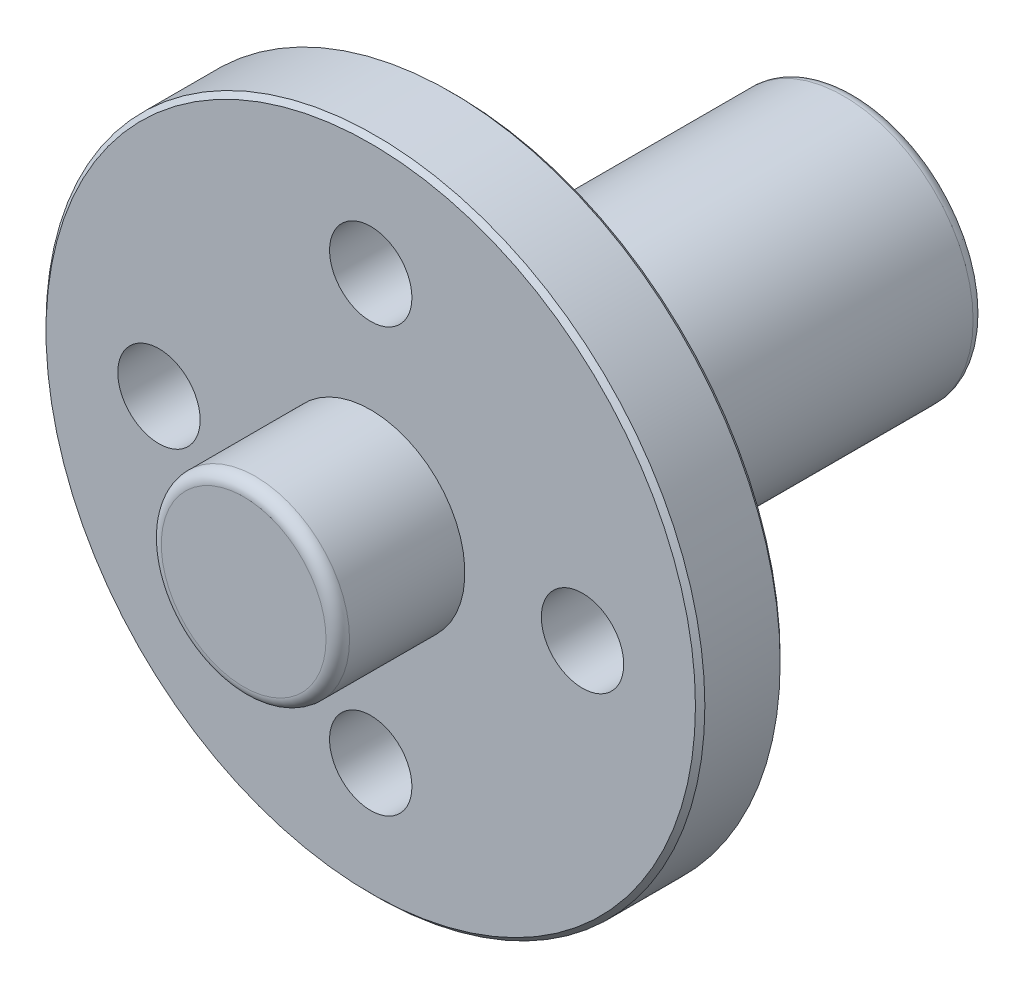
ISO-10303-21;
HEADER;
FILE_DESCRIPTION(('STEP AP214'),'2;1');
FILE_NAME('part.step','',(''),(''),'','','');
FILE_SCHEMA(('AUTOMOTIVE_DESIGN { 1 0 10303 214 1 1 1 1 }'));
ENDSEC;
DATA;
#1=APPLICATION_CONTEXT('core data for automotive mechanical design processes');
#2=APPLICATION_PROTOCOL_DEFINITION('international standard','automotive_design',2000,#1);
#3=PRODUCT_CONTEXT('',#1,'mechanical');
#4=PRODUCT('Part','Part','',(#3));
#5=PRODUCT_RELATED_PRODUCT_CATEGORY('part','',(#4));
#6=PRODUCT_DEFINITION_FORMATION('','',#4);
#7=PRODUCT_DEFINITION_CONTEXT('part definition',#1,'design');
#8=PRODUCT_DEFINITION('design','',#6,#7);
#9=PRODUCT_DEFINITION_SHAPE('','',#8);
#10=(LENGTH_UNIT() NAMED_UNIT(*) SI_UNIT(.MILLI.,.METRE.));
#11=(NAMED_UNIT(*) PLANE_ANGLE_UNIT() SI_UNIT($,.RADIAN.));
#12=(NAMED_UNIT(*) SI_UNIT($,.STERADIAN.) SOLID_ANGLE_UNIT());
#13=UNCERTAINTY_MEASURE_WITH_UNIT(LENGTH_MEASURE(1.E-05),#10,'distance_accuracy_value','');
#14=(GEOMETRIC_REPRESENTATION_CONTEXT(3) GLOBAL_UNCERTAINTY_ASSIGNED_CONTEXT((#13)) GLOBAL_UNIT_ASSIGNED_CONTEXT((#10,
#11,#12)) REPRESENTATION_CONTEXT('',''));
#15=CARTESIAN_POINT('',(0.,0.,0.));
#16=DIRECTION('',(0.,0.,1.));
#17=DIRECTION('',(1.,0.,0.));
#18=AXIS2_PLACEMENT_3D('',#15,#16,#17);
#19=CARTESIAN_POINT('',(0.,0.,3.6));
#20=DIRECTION('',(0.,0.,-1.));
#21=DIRECTION('',(-1.,0.,0.));
#22=AXIS2_PLACEMENT_3D('',#19,#20,#21);
#23=CYLINDRICAL_SURFACE('',#22,14.);
#24=CARTESIAN_POINT('',(0.,0.,0.2));
#25=DIRECTION('',(0.,0.,1.));
#26=DIRECTION('',(1.,0.,0.));
#27=AXIS2_PLACEMENT_3D('',#24,#25,#26);
#28=CIRCLE('',#27,14.);
#29=CARTESIAN_POINT('',(14.,0.,0.2));
#30=VERTEX_POINT('',#29);
#31=EDGE_CURVE('E60',#30,#30,#28,.T.);
#32=ORIENTED_EDGE('',*,*,#31,.T.);
#33=EDGE_LOOP('',(#32));
#34=FACE_BOUND('',#33,.T.);
#35=CARTESIAN_POINT('',(0.,0.,3.4));
#36=DIRECTION('',(0.,0.,1.));
#37=DIRECTION('',(1.,0.,0.));
#38=AXIS2_PLACEMENT_3D('',#35,#36,#37);
#39=CIRCLE('',#38,14.);
#40=CARTESIAN_POINT('',(14.,0.,3.4));
#41=VERTEX_POINT('',#40);
#42=EDGE_CURVE('E65',#41,#41,#39,.F.);
#43=ORIENTED_EDGE('',*,*,#42,.T.);
#44=EDGE_LOOP('',(#43));
#45=FACE_BOUND('',#44,.T.);
#46=ADVANCED_FACE('F46',(#34,#45),#23,.T.);
#47=CARTESIAN_POINT('',(0.,0.,3.6));
#48=DIRECTION('',(0.,0.,1.));
#49=DIRECTION('',(1.,0.,0.));
#50=AXIS2_PLACEMENT_3D('',#47,#48,#49);
#51=PLANE('',#50);
#52=CARTESIAN_POINT('',(0.,0.,3.6));
#53=DIRECTION('',(0.,0.,1.));
#54=DIRECTION('',(1.,0.,0.));
#55=AXIS2_PLACEMENT_3D('',#52,#53,#54);
#56=CIRCLE('',#55,13.8);
#57=CARTESIAN_POINT('',(13.8,0.,3.6));
#58=VERTEX_POINT('',#57);
#59=EDGE_CURVE('E12',#58,#58,#56,.T.);
#60=ORIENTED_EDGE('',*,*,#59,.T.);
#61=EDGE_LOOP('',(#60));
#62=FACE_BOUND('',#61,.T.);
#63=CARTESIAN_POINT('',(9.,0.,3.6));
#64=DIRECTION('',(0.,0.,1.));
#65=DIRECTION('',(1.,0.,0.));
#66=AXIS2_PLACEMENT_3D('',#63,#64,#65);
#67=CIRCLE('',#66,1.75);
#68=CARTESIAN_POINT('',(10.75,0.,3.6));
#69=VERTEX_POINT('',#68);
#70=EDGE_CURVE('E356',#69,#69,#67,.T.);
#71=ORIENTED_EDGE('',*,*,#70,.F.);
#72=EDGE_LOOP('',(#71));
#73=FACE_BOUND('',#72,.T.);
#74=CARTESIAN_POINT('',(0.,-9.,3.6));
#75=DIRECTION('',(0.,0.,1.));
#76=DIRECTION('',(1.,0.,0.));
#77=AXIS2_PLACEMENT_3D('',#74,#75,#76);
#78=CIRCLE('',#77,1.75);
#79=CARTESIAN_POINT('',(1.75,-9.,3.6));
#80=VERTEX_POINT('',#79);
#81=EDGE_CURVE('E360',#80,#80,#78,.T.);
#82=ORIENTED_EDGE('',*,*,#81,.F.);
#83=EDGE_LOOP('',(#82));
#84=FACE_BOUND('',#83,.T.);
#85=CARTESIAN_POINT('',(-9.,0.,3.6));
#86=DIRECTION('',(0.,0.,1.));
#87=DIRECTION('',(1.,0.,0.));
#88=AXIS2_PLACEMENT_3D('',#85,#86,#87);
#89=CIRCLE('',#88,1.75);
#90=CARTESIAN_POINT('',(-7.25,0.,3.6));
#91=VERTEX_POINT('',#90);
#92=EDGE_CURVE('E364',#91,#91,#89,.T.);
#93=ORIENTED_EDGE('',*,*,#92,.F.);
#94=EDGE_LOOP('',(#93));
#95=FACE_BOUND('',#94,.T.);
#96=CARTESIAN_POINT('',(0.,9.,3.6));
#97=DIRECTION('',(0.,0.,1.));
#98=DIRECTION('',(1.,0.,0.));
#99=AXIS2_PLACEMENT_3D('',#96,#97,#98);
#100=CIRCLE('',#99,1.75);
#101=CARTESIAN_POINT('',(1.75,9.,3.6));
#102=VERTEX_POINT('',#101);
#103=EDGE_CURVE('E341',#102,#102,#100,.T.);
#104=ORIENTED_EDGE('',*,*,#103,.F.);
#105=EDGE_LOOP('',(#104));
#106=FACE_BOUND('',#105,.T.);
#107=CARTESIAN_POINT('',(0.,0.,3.6));
#108=DIRECTION('',(0.,0.,1.));
#109=DIRECTION('',(1.,0.,0.));
#110=AXIS2_PLACEMENT_3D('',#107,#108,#109);
#111=CIRCLE('',#110,4.);
#112=CARTESIAN_POINT('',(-4.,0.,3.6));
#113=VERTEX_POINT('',#112);
#114=EDGE_CURVE('E98',#113,#113,#111,.T.);
#115=ORIENTED_EDGE('',*,*,#114,.F.);
#116=EDGE_LOOP('',(#115));
#117=FACE_BOUND('',#116,.T.);
#118=ADVANCED_FACE('F139',(#62,#73,#84,#95,#106,#117),#51,.T.);
#119=CARTESIAN_POINT('',(0.,0.,0.));
#120=DIRECTION('',(0.,0.,1.));
#121=DIRECTION('',(1.,0.,0.));
#122=AXIS2_PLACEMENT_3D('',#119,#120,#121);
#123=PLANE('',#122);
#124=CARTESIAN_POINT('',(0.,0.,0.));
#125=DIRECTION('',(0.,0.,1.));
#126=DIRECTION('',(1.,0.,0.));
#127=AXIS2_PLACEMENT_3D('',#124,#125,#126);
#128=CIRCLE('',#127,13.8);
#129=CARTESIAN_POINT('',(13.8,0.,0.));
#130=VERTEX_POINT('',#129);
#131=EDGE_CURVE('E55',#130,#130,#128,.F.);
#132=ORIENTED_EDGE('',*,*,#131,.T.);
#133=EDGE_LOOP('',(#132));
#134=FACE_BOUND('',#133,.T.);
#135=CARTESIAN_POINT('',(9.,0.,0.));
#136=DIRECTION('',(0.,0.,-1.));
#137=DIRECTION('',(0.,1.,0.));
#138=AXIS2_PLACEMENT_3D('',#135,#136,#137);
#139=CIRCLE('',#138,1.75);
#140=CARTESIAN_POINT('',(9.00000000000001,1.74999999999997,0.));
#141=VERTEX_POINT('',#140);
#142=EDGE_CURVE('E122',#141,#141,#139,.T.);
#143=ORIENTED_EDGE('',*,*,#142,.F.);
#144=EDGE_LOOP('',(#143));
#145=FACE_BOUND('',#144,.T.);
#146=CARTESIAN_POINT('',(0.,-9.,0.));
#147=DIRECTION('',(0.,0.,-1.));
#148=DIRECTION('',(1.,0.,0.));
#149=AXIS2_PLACEMENT_3D('',#146,#147,#148);
#150=CIRCLE('',#149,1.75);
#151=CARTESIAN_POINT('',(1.75,-9.,0.));
#152=VERTEX_POINT('',#151);
#153=EDGE_CURVE('E370',#152,#152,#150,.T.);
#154=ORIENTED_EDGE('',*,*,#153,.F.);
#155=EDGE_LOOP('',(#154));
#156=FACE_BOUND('',#155,.T.);
#157=CARTESIAN_POINT('',(-9.,0.,0.));
#158=DIRECTION('',(0.,0.,-1.));
#159=DIRECTION('',(0.,-1.,0.));
#160=AXIS2_PLACEMENT_3D('',#157,#158,#159);
#161=CIRCLE('',#160,1.75);
#162=CARTESIAN_POINT('',(-9.00000000000002,-1.74999999999991,0.));
#163=VERTEX_POINT('',#162);
#164=EDGE_CURVE('E121',#163,#163,#161,.T.);
#165=ORIENTED_EDGE('',*,*,#164,.F.);
#166=EDGE_LOOP('',(#165));
#167=FACE_BOUND('',#166,.T.);
#168=CARTESIAN_POINT('',(0.,9.,0.));
#169=DIRECTION('',(0.,0.,-1.));
#170=DIRECTION('',(-1.,0.,0.));
#171=AXIS2_PLACEMENT_3D('',#168,#169,#170);
#172=CIRCLE('',#171,1.75);
#173=CARTESIAN_POINT('',(-1.75,9.,0.));
#174=VERTEX_POINT('',#173);
#175=EDGE_CURVE('E352',#174,#174,#172,.T.);
#176=ORIENTED_EDGE('',*,*,#175,.F.);
#177=EDGE_LOOP('',(#176));
#178=FACE_BOUND('',#177,.T.);
#179=CARTESIAN_POINT('',(0.,0.,0.));
#180=DIRECTION('',(0.,0.,-1.));
#181=DIRECTION('',(-1.,0.,0.));
#182=AXIS2_PLACEMENT_3D('',#179,#180,#181);
#183=CIRCLE('',#182,5.5);
#184=CARTESIAN_POINT('',(-5.5,0.,0.));
#185=VERTEX_POINT('',#184);
#186=EDGE_CURVE('E87',#185,#185,#183,.T.);
#187=ORIENTED_EDGE('',*,*,#186,.F.);
#188=EDGE_LOOP('',(#187));
#189=FACE_BOUND('',#188,.T.);
#190=ADVANCED_FACE('F137',(#134,#145,#156,#167,#178,#189),#123,.F.);
#191=CARTESIAN_POINT('',(0.,0.,9.));
#192=DIRECTION('',(0.,0.,-1.));
#193=DIRECTION('',(-1.,0.,0.));
#194=AXIS2_PLACEMENT_3D('',#191,#192,#193);
#195=CYLINDRICAL_SURFACE('',#194,4.);
#196=CARTESIAN_POINT('',(0.,0.,8.5));
#197=DIRECTION('',(0.,0.,1.));
#198=DIRECTION('',(1.,0.,0.));
#199=AXIS2_PLACEMENT_3D('',#196,#197,#198);
#200=CIRCLE('',#199,4.);
#201=CARTESIAN_POINT('',(-4.,0.,8.5));
#202=VERTEX_POINT('',#201);
#203=EDGE_CURVE('E71',#202,#202,#200,.F.);
#204=CARTESIAN_POINT('',(-4.,0.,8.5));
#205=CARTESIAN_POINT('',(-4.,0.,8.44895833333333));
#206=CARTESIAN_POINT('',(-4.,0.,8.39791666666667));
#207=CARTESIAN_POINT('',(-4.,0.,8.29583333333333));
#208=CARTESIAN_POINT('',(-4.,0.,8.24479166666667));
#209=CARTESIAN_POINT('',(-4.,0.,8.14270833333333));
#210=CARTESIAN_POINT('',(-4.,0.,8.09166666666667));
#211=CARTESIAN_POINT('',(-4.,0.,7.98958333333333));
#212=CARTESIAN_POINT('',(-4.,0.,7.93854166666667));
#213=CARTESIAN_POINT('',(-4.,0.,7.83645833333333));
#214=CARTESIAN_POINT('',(-4.,0.,7.78541666666667));
#215=CARTESIAN_POINT('',(-4.,0.,7.68333333333333));
#216=CARTESIAN_POINT('',(-4.,0.,7.63229166666667));
#217=CARTESIAN_POINT('',(-4.,0.,7.53020833333333));
#218=CARTESIAN_POINT('',(-4.,0.,7.47916666666667));
#219=CARTESIAN_POINT('',(-4.,0.,7.37708333333333));
#220=CARTESIAN_POINT('',(-4.,0.,7.32604166666667));
#221=CARTESIAN_POINT('',(-4.,0.,7.22395833333333));
#222=CARTESIAN_POINT('',(-4.,0.,7.17291666666667));
#223=CARTESIAN_POINT('',(-4.,0.,7.07083333333333));
#224=CARTESIAN_POINT('',(-4.,0.,7.01979166666667));
#225=CARTESIAN_POINT('',(-4.,0.,6.91770833333333));
#226=CARTESIAN_POINT('',(-4.,0.,6.86666666666667));
#227=CARTESIAN_POINT('',(-4.,0.,6.76458333333333));
#228=CARTESIAN_POINT('',(-4.,0.,6.71354166666667));
#229=CARTESIAN_POINT('',(-4.,0.,6.61145833333333));
#230=CARTESIAN_POINT('',(-4.,0.,6.56041666666667));
#231=CARTESIAN_POINT('',(-4.,0.,6.45833333333333));
#232=CARTESIAN_POINT('',(-4.,0.,6.40729166666667));
#233=CARTESIAN_POINT('',(-4.,0.,6.30520833333333));
#234=CARTESIAN_POINT('',(-4.,0.,6.25416666666667));
#235=CARTESIAN_POINT('',(-4.,0.,6.15208333333333));
#236=CARTESIAN_POINT('',(-4.,0.,6.10104166666667));
#237=CARTESIAN_POINT('',(-4.,0.,5.99895833333333));
#238=CARTESIAN_POINT('',(-4.,0.,5.94791666666667));
#239=CARTESIAN_POINT('',(-4.,0.,5.84583333333333));
#240=CARTESIAN_POINT('',(-4.,0.,5.79479166666667));
#241=CARTESIAN_POINT('',(-4.,0.,5.69270833333333));
#242=CARTESIAN_POINT('',(-4.,0.,5.64166666666667));
#243=CARTESIAN_POINT('',(-4.,0.,5.53958333333333));
#244=CARTESIAN_POINT('',(-4.,0.,5.48854166666667));
#245=CARTESIAN_POINT('',(-4.,0.,5.38645833333333));
#246=CARTESIAN_POINT('',(-4.,0.,5.33541666666667));
#247=CARTESIAN_POINT('',(-4.,0.,5.23333333333333));
#248=CARTESIAN_POINT('',(-4.,0.,5.18229166666667));
#249=CARTESIAN_POINT('',(-4.,0.,5.08020833333333));
#250=CARTESIAN_POINT('',(-4.,0.,5.02916666666667));
#251=CARTESIAN_POINT('',(-4.,0.,4.92708333333333));
#252=CARTESIAN_POINT('',(-4.,0.,4.87604166666667));
#253=CARTESIAN_POINT('',(-4.,0.,4.77395833333333));
#254=CARTESIAN_POINT('',(-4.,0.,4.72291666666667));
#255=CARTESIAN_POINT('',(-4.,0.,4.62083333333333));
#256=CARTESIAN_POINT('',(-4.,0.,4.56979166666667));
#257=CARTESIAN_POINT('',(-4.,0.,4.46770833333333));
#258=CARTESIAN_POINT('',(-4.,0.,4.41666666666667));
#259=CARTESIAN_POINT('',(-4.,0.,4.31458333333333));
#260=CARTESIAN_POINT('',(-4.,0.,4.26354166666667));
#261=CARTESIAN_POINT('',(-4.,0.,4.16145833333333));
#262=CARTESIAN_POINT('',(-4.,0.,4.11041666666667));
#263=CARTESIAN_POINT('',(-4.,0.,4.00833333333333));
#264=CARTESIAN_POINT('',(-4.,0.,3.95729166666667));
#265=CARTESIAN_POINT('',(-4.,0.,3.85520833333333));
#266=CARTESIAN_POINT('',(-4.,0.,3.80416666666667));
#267=CARTESIAN_POINT('',(-4.,0.,3.70208333333333));
#268=CARTESIAN_POINT('',(-4.,0.,3.65104166666667));
#269=CARTESIAN_POINT('',(-4.,0.,3.6));
#270=B_SPLINE_CURVE_WITH_KNOTS('',3,(#204,#205,#206,#207,#208,#209,#210,#211,#212,#213,#214,
#215,#216,#217,#218,#219,#220,#221,#222,#223,#224,#225,#226,#227,#228,#229,#230,#231,#232,#233,
#234,#235,#236,#237,#238,#239,#240,#241,#242,#243,#244,#245,#246,#247,#248,#249,#250,#251,#252,
#253,#254,#255,#256,#257,#258,#259,#260,#261,#262,#263,#264,#265,#266,#267,#268,#269),
.UNSPECIFIED.,.F.,.F.,(4,2,2,2,2,2,2,2,2,2,2,2,2,2,2,2,2,2,2,2,2,2,2,2,2,2,2,2,2,2,2,2,4),(0.,
0.153124999999999,0.306249999999999,0.459375,0.612499999999998,0.765624999999999,
0.918749999999999,1.071875,1.225,1.378125,1.53125,1.684375,1.8375,1.990625,2.14375,2.296875,
2.45,2.603125,2.75625,2.909375,3.0625,3.215625,3.36875,3.521875,3.675,3.828125,3.98125,4.134375,
4.2875,4.440625,4.59375,4.746875,4.9),.UNSPECIFIED.);
#271=EDGE_CURVE('BSEAM133',#202,#113,#270,.T.);
#272=ORIENTED_EDGE('',*,*,#203,.T.);
#273=ORIENTED_EDGE('',*,*,#114,.T.);
#274=ORIENTED_EDGE('',*,*,#271,.T.);
#275=ORIENTED_EDGE('',*,*,#271,.F.);
#276=EDGE_LOOP('',(#272,#274,#273,#275));
#277=FACE_BOUND('',#276,.T.);
#278=ADVANCED_FACE('F133',(#277),#195,.T.);
#279=CARTESIAN_POINT('',(0.,0.,9.));
#280=DIRECTION('',(0.,0.,1.));
#281=DIRECTION('',(1.,0.,0.));
#282=AXIS2_PLACEMENT_3D('',#279,#280,#281);
#283=PLANE('',#282);
#284=CARTESIAN_POINT('',(0.,0.,9.));
#285=DIRECTION('',(0.,0.,1.));
#286=DIRECTION('',(1.,0.,0.));
#287=AXIS2_PLACEMENT_3D('',#284,#285,#286);
#288=CIRCLE('',#287,3.5);
#289=CARTESIAN_POINT('',(3.5,0.,9.));
#290=VERTEX_POINT('',#289);
#291=EDGE_CURVE('E75',#290,#290,#288,.T.);
#292=ORIENTED_EDGE('',*,*,#291,.T.);
#293=EDGE_LOOP('',(#292));
#294=FACE_BOUND('',#293,.T.);
#295=ADVANCED_FACE('F129',(#294),#283,.T.);
#296=CARTESIAN_POINT('',(0.,0.,-17.));
#297=DIRECTION('',(0.,0.,1.));
#298=DIRECTION('',(1.,0.,0.));
#299=AXIS2_PLACEMENT_3D('',#296,#297,#298);
#300=CYLINDRICAL_SURFACE('',#299,5.5);
#301=CARTESIAN_POINT('',(0.,0.,-16.5));
#302=DIRECTION('',(0.,0.,-1.));
#303=DIRECTION('',(-1.,0.,0.));
#304=AXIS2_PLACEMENT_3D('',#301,#302,#303);
#305=CIRCLE('',#304,5.5);
#306=CARTESIAN_POINT('',(-5.5,0.,-16.5));
#307=VERTEX_POINT('',#306);
#308=EDGE_CURVE('E79',#307,#307,#305,.F.);
#309=ORIENTED_EDGE('',*,*,#308,.T.);
#310=EDGE_LOOP('',(#309));
#311=FACE_BOUND('',#310,.T.);
#312=CARTESIAN_POINT('',(0.,-5.5,-9.25));
#313=CARTESIAN_POINT('',(0.0957269565011819,-5.49999970390343,-9.2500003560453));
#314=CARTESIAN_POINT('',(0.191458016099595,-5.49747737607821,-9.25788035677476));
#315=CARTESIAN_POINT('',(0.380115126410566,-5.4876627753594,-9.28910586620763));
#316=CARTESIAN_POINT('',(0.473040631526423,-5.48036958084595,-9.31245436307377));
#317=CARTESIAN_POINT('',(0.653339115590298,-5.46180884308535,-9.3737459025554));
#318=CARTESIAN_POINT('',(0.740720621291876,-5.45054758667823,-9.41166586727));
#319=CARTESIAN_POINT('',(0.907884643194976,-5.42520988974348,-9.50092410432208));
#320=CARTESIAN_POINT('',(0.987665875272176,-5.41113297472977,-9.55226463870048));
#321=CARTESIAN_POINT('',(1.13990943224763,-5.38115262585258,-9.66862926862347));
#322=CARTESIAN_POINT('',(1.2120954742211,-5.36520832184273,-9.73400425843164));
#323=CARTESIAN_POINT('',(1.34468623549642,-5.33352371951507,-9.87583522607003));
#324=CARTESIAN_POINT('',(1.40508865839976,-5.31778346151871,-9.95229335873924));
#325=CARTESIAN_POINT('',(1.51391658522971,-5.28784763379036,-10.1165374423305));
#326=CARTESIAN_POINT('',(1.56199322125746,-5.2737023408234,-10.2045645896092));
#327=CARTESIAN_POINT('',(1.64254455879642,-5.24917452933664,-10.3879775531033));
#328=CARTESIAN_POINT('',(1.67502354214116,-5.23879097834413,-10.4833613414355));
#329=CARTESIAN_POINT('',(1.72243983182188,-5.22339057458748,-10.6756556279128));
#330=CARTESIAN_POINT('',(1.73789106620494,-5.21821692266284,-10.7724264873046));
#331=CARTESIAN_POINT('',(1.75241914239356,-5.21335700674595,-10.9673146975367));
#332=CARTESIAN_POINT('',(1.75150052185658,-5.21366922209319,-11.0654316677053));
#333=CARTESIAN_POINT('',(1.73371613817389,-5.21960762396158,-11.2559411944999));
#334=CARTESIAN_POINT('',(1.71750822888944,-5.22501458741932,-11.3484031562964));
#335=CARTESIAN_POINT('',(1.67067371892857,-5.24017643369277,-11.529220390042));
#336=CARTESIAN_POINT('',(1.64004553449478,-5.24993179408016,-11.6175752097384));
#337=CARTESIAN_POINT('',(1.56478449132224,-5.27285607733844,-11.789217785078));
#338=CARTESIAN_POINT('',(1.51994819892564,-5.28607406947825,-11.8724095045605));
#339=CARTESIAN_POINT('',(1.41768493229958,-5.31441231483129,-12.0303021364852));
#340=CARTESIAN_POINT('',(1.36025458747796,-5.32953307682718,-12.1050007677489));
#341=CARTESIAN_POINT('',(1.23122363545836,-5.36084807422293,-12.2475000535733));
#342=CARTESIAN_POINT('',(1.15908132347558,-5.37705925784739,-12.3148074076848));
#343=CARTESIAN_POINT('',(1.0043320455676,-5.40809918297801,-12.4364909394036));
#344=CARTESIAN_POINT('',(0.921724247268001,-5.42292781435959,-12.4908660874545));
#345=CARTESIAN_POINT('',(0.747412833673483,-5.44969752456623,-12.5854924765768));
#346=CARTESIAN_POINT('',(0.655639134264695,-5.46161350163423,-12.6256221989643));
#347=CARTESIAN_POINT('',(0.466175706635206,-5.48103386886388,-12.6897256662661));
#348=CARTESIAN_POINT('',(0.36848785409011,-5.48853964971964,-12.7137045044869));
#349=CARTESIAN_POINT('',(0.174153405291636,-5.49806837741333,-12.7439762708952));
#350=CARTESIAN_POINT('',(0.07762077337823,-5.5002981331288,-12.7509366699897));
#351=CARTESIAN_POINT('',(-0.11524567034245,-5.4996375197947,-12.7488610910329));
#352=CARTESIAN_POINT('',(-0.211579510151112,-5.49674792928555,-12.7398275453104));
#353=CARTESIAN_POINT('',(-0.398713426259411,-5.48630938847197,-12.7065544019426));
#354=CARTESIAN_POINT('',(-0.489592226321842,-5.47888324092067,-12.6827153102153));
#355=CARTESIAN_POINT('',(-0.666031956960266,-5.46024527783549,-12.6209996817072));
#356=CARTESIAN_POINT('',(-0.751592222394665,-5.44903298992619,-12.5831213932772));
#357=CARTESIAN_POINT('',(-0.917339442476725,-5.42362407539948,-12.4933494002318));
#358=CARTESIAN_POINT('',(-0.997339315603261,-5.4093600306033,-12.4411298973006));
#359=CARTESIAN_POINT('',(-1.14766287818712,-5.37947519822166,-12.3245464379561));
#360=CARTESIAN_POINT('',(-1.21798384311902,-5.36385403062864,-12.2601790740705));
#361=CARTESIAN_POINT('',(-1.34996104718628,-5.33220445158753,-12.1179870561385));
#362=CARTESIAN_POINT('',(-1.4111413110731,-5.31618575474756,-12.0397174341752));
#363=CARTESIAN_POINT('',(-1.51954611792946,-5.2862229901723,-11.8736751532265));
#364=CARTESIAN_POINT('',(-1.56677080320365,-5.27227890128302,-11.7859025911548));
#365=CARTESIAN_POINT('',(-1.64564747260271,-5.24819488876751,-11.6034745958211));
#366=CARTESIAN_POINT('',(-1.67735299546918,-5.23804191554066,-11.5088441374333));
#367=CARTESIAN_POINT('',(-1.72425807813232,-5.22279180335057,-11.3151959773387));
#368=CARTESIAN_POINT('',(-1.73946421932544,-5.21769264855285,-11.2161800413602));
#369=CARTESIAN_POINT('',(-1.75245504651122,-5.21334278633284,-11.0215622835651));
#370=CARTESIAN_POINT('',(-1.75102295341289,-5.21382913642299,-10.9260179902403));
#371=CARTESIAN_POINT('',(-1.73267854277503,-5.21995368121661,-10.7366040532281));
#372=CARTESIAN_POINT('',(-1.71576699789008,-5.22559161877933,-10.6427343261933));
#373=CARTESIAN_POINT('',(-1.66747636074962,-5.24119704125792,-10.4607912147369));
#374=CARTESIAN_POINT('',(-1.63632923640125,-5.2510949646102,-10.3726498407235));
#375=CARTESIAN_POINT('',(-1.56063550405838,-5.27408515029457,-10.2027742749829));
#376=CARTESIAN_POINT('',(-1.51608610003643,-5.2871780790714,-10.1210414247127));
#377=CARTESIAN_POINT('',(-1.41275121234936,-5.31574207702443,-9.96273156215861));
#378=CARTESIAN_POINT('',(-1.35346380951176,-5.33128779040915,-9.88649568691197));
#379=CARTESIAN_POINT('',(-1.22320973366265,-5.3626709456395,-9.74480140774486));
#380=CARTESIAN_POINT('',(-1.15223989064002,-5.37850846562764,-9.67934593874087));
#381=CARTESIAN_POINT('',(-0.997708261903579,-5.40934253989511,-9.5588188678458));
#382=CARTESIAN_POINT('',(-0.913798082297969,-5.42429161996817,-9.50418041250852));
#383=CARTESIAN_POINT('',(-0.737509491539474,-5.45105588310856,-9.40985404940951));
#384=CARTESIAN_POINT('',(-0.645134120941602,-5.46287218552634,-9.3701607995474));
#385=CARTESIAN_POINT('',(-0.461587254382787,-5.4813142880744,-9.30941414576355));
#386=CARTESIAN_POINT('',(-0.370831424002811,-5.48825917667784,-9.28719987588089));
#387=CARTESIAN_POINT('',(-0.186717977824863,-5.49760167571682,-9.25749425250529));
#388=CARTESIAN_POINT('',(-0.0933609403009458,-5.50000028877816,-9.24999965275482));
#389=CARTESIAN_POINT('',(0.,-5.5,-9.25));
#390=B_SPLINE_CURVE_WITH_KNOTS('',3,(#312,#313,#314,#315,#316,#317,#318,#319,#320,#321,#322,
#323,#324,#325,#326,#327,#328,#329,#330,#331,#332,#333,#334,#335,#336,#337,#338,#339,#340,#341,
#342,#343,#344,#345,#346,#347,#348,#349,#350,#351,#352,#353,#354,#355,#356,#357,#358,#359,#360,
#361,#362,#363,#364,#365,#366,#367,#368,#369,#370,#371,#372,#373,#374,#375,#376,#377,#378,#379,
#380,#381,#382,#383,#384,#385,#386,#387,#388,#389),.UNSPECIFIED.,.T.,.F.,(4,2,2,2,2,2,2,2,2,2,2,
2,2,2,2,2,2,2,2,2,2,2,2,2,2,2,2,2,2,2,2,2,2,2,2,2,2,2,4),(0.,0.286837598450664,
0.573730623584568,0.860171135562671,1.14665995833779,1.44138341379001,1.73616424786955,
2.03854373039545,2.34084015684935,2.6337391395857,2.92655693317401,3.20732393275783,
3.48812177575904,3.77313705601336,4.05822870924382,4.35680323057352,4.65540151400929,
4.95648897881507,5.25748144884547,5.54646474589774,5.83540409869412,6.11684868899013,
6.39832840652438,6.6868239170514,6.97540047110321,7.27585885259468,7.57631417021448,
7.87572552636909,8.17501740713293,8.46027994117325,8.7455282371521,9.02628560455591,
9.3071015851467,9.59924915680453,9.89147613330327,10.1937259490528,10.4958676240884,
10.775677374151,11.0554254083914),.UNSPECIFIED.);
#391=CARTESIAN_POINT('',(0.,-5.5,-9.25));
#392=VERTEX_POINT('',#391);
#393=EDGE_CURVE('E97',#392,#392,#390,.T.);
#394=ORIENTED_EDGE('',*,*,#393,.T.);
#395=EDGE_LOOP('',(#394));
#396=FACE_BOUND('',#395,.T.);
#397=ORIENTED_EDGE('',*,*,#186,.T.);
#398=EDGE_LOOP('',(#397));
#399=FACE_BOUND('',#398,.T.);
#400=ADVANCED_FACE('F124',(#311,#396,#399),#300,.T.);
#401=CARTESIAN_POINT('',(0.,0.,-17.));
#402=DIRECTION('',(0.,0.,-1.));
#403=DIRECTION('',(-1.,0.,0.));
#404=AXIS2_PLACEMENT_3D('',#401,#402,#403);
#405=PLANE('',#404);
#406=CARTESIAN_POINT('',(0.,0.,-17.));
#407=DIRECTION('',(0.,0.,-1.));
#408=DIRECTION('',(-1.,0.,0.));
#409=AXIS2_PLACEMENT_3D('',#406,#407,#408);
#410=CIRCLE('',#409,5.);
#411=CARTESIAN_POINT('',(-5.,0.,-17.));
#412=VERTEX_POINT('',#411);
#413=EDGE_CURVE('E83',#412,#412,#410,.T.);
#414=ORIENTED_EDGE('',*,*,#413,.T.);
#415=EDGE_LOOP('',(#414));
#416=FACE_BOUND('',#415,.T.);
#417=CARTESIAN_POINT('',(0.,0.,-17.));
#418=DIRECTION('',(0.,0.,-1.));
#419=DIRECTION('',(-1.,0.,0.));
#420=AXIS2_PLACEMENT_3D('',#417,#418,#419);
#421=CIRCLE('',#420,3.5);
#422=CARTESIAN_POINT('',(-3.5,0.,-17.));
#423=VERTEX_POINT('',#422);
#424=EDGE_CURVE('E335',#423,#423,#421,.T.);
#425=ORIENTED_EDGE('',*,*,#424,.F.);
#426=EDGE_LOOP('',(#425));
#427=FACE_BOUND('',#426,.T.);
#428=ADVANCED_FACE('F128',(#416,#427),#405,.T.);
#429=CARTESIAN_POINT('',(0.,0.,0.));
#430=DIRECTION('',(0.,0.,-1.));
#431=DIRECTION('',(-1.,0.,0.));
#432=AXIS2_PLACEMENT_3D('',#429,#430,#431);
#433=CYLINDRICAL_SURFACE('',#432,3.5);
#434=CARTESIAN_POINT('',(0.,-3.5,-9.25));
#435=CARTESIAN_POINT('',(-0.0920009351646578,-3.49999498458822,-9.25000577905509));
#436=CARTESIAN_POINT('',(-0.184111549470733,-3.49633359284574,-9.25729762796185));
#437=CARTESIAN_POINT('',(-0.365610411720567,-3.48204773065025,-9.28614254059769));
#438=CARTESIAN_POINT('',(-0.454993151748851,-3.47141003700609,-9.30772268774618));
#439=CARTESIAN_POINT('',(-0.628133703540785,-3.44428488955907,-9.3640891650791));
#440=CARTESIAN_POINT('',(-0.711911905143505,-3.4278201856069,-9.39882417243394));
#441=CARTESIAN_POINT('',(-0.872327079411547,-3.39055108902583,-9.48024858738872));
#442=CARTESIAN_POINT('',(-0.948964614482603,-3.36974703858669,-9.52693705243551));
#443=CARTESIAN_POINT('',(-1.09813868108334,-3.32423451951608,-9.63415518659925));
#444=CARTESIAN_POINT('',(-1.17014661946369,-3.2993659847319,-9.69535133866937));
#445=CARTESIAN_POINT('',(-1.30336402851721,-3.249049479318,-9.82841258868232));
#446=CARTESIAN_POINT('',(-1.36456527043684,-3.22360108365811,-9.90028574060177));
#447=CARTESIAN_POINT('',(-1.47919100078798,-3.17273164595358,-10.0593458616659));
#448=CARTESIAN_POINT('',(-1.53164433721536,-3.14746577197731,-10.1472881721053));
#449=CARTESIAN_POINT('',(-1.62079439705872,-3.10250462851561,-10.3321428379759));
#450=CARTESIAN_POINT('',(-1.65750237619108,-3.08280538312232,-10.4290487252648));
#451=CARTESIAN_POINT('',(-1.71173177383003,-3.05301267316165,-10.6231639344884));
#452=CARTESIAN_POINT('',(-1.73027024989077,-3.04241475271499,-10.7200077911179));
#453=CARTESIAN_POINT('',(-1.75074723829048,-3.03068307409923,-10.9159629661141));
#454=CARTESIAN_POINT('',(-1.75270215465288,-3.02953996350754,-11.0150719465245));
#455=CARTESIAN_POINT('',(-1.74070275255151,-3.03644127950185,-11.2000005425519));
#456=CARTESIAN_POINT('',(-1.72862297918944,-3.04340336408524,-11.2859920546403));
#457=CARTESIAN_POINT('',(-1.69214473584963,-3.06383400284238,-11.4545133414028));
#458=CARTESIAN_POINT('',(-1.66774234182089,-3.07730462955609,-11.5370420042843));
#459=CARTESIAN_POINT('',(-1.60686711567551,-3.10953083722297,-11.6986509819899));
#460=CARTESIAN_POINT('',(-1.57012636745299,-3.12840221161997,-11.7776061978751));
#461=CARTESIAN_POINT('',(-1.485822953419,-3.16930957492456,-11.9286100120325));
#462=CARTESIAN_POINT('',(-1.43825542667182,-3.19134698365334,-12.0006554873002));
#463=CARTESIAN_POINT('',(-1.32661559609738,-3.2394802633075,-12.1454121923006));
#464=CARTESIAN_POINT('',(-1.26121530214624,-3.26573642914306,-12.2170495287583));
#465=CARTESIAN_POINT('',(-1.1192222627974,-3.31708340775713,-12.3487869825341));
#466=CARTESIAN_POINT('',(-1.042624199005,-3.34217365927902,-12.4088815860593));
#467=CARTESIAN_POINT('',(-0.875903885205733,-3.38978477745187,-12.518449906802));
#468=CARTESIAN_POINT('',(-0.785318785298964,-3.41213222283513,-12.56730082678));
#469=CARTESIAN_POINT('',(-0.595815877105393,-3.45026291962174,-12.6486698008253));
#470=CARTESIAN_POINT('',(-0.496904758464231,-3.46605138151218,-12.6812008237765));
#471=CARTESIAN_POINT('',(-0.302341360406227,-3.48817584047512,-12.7263319565042));
#472=CARTESIAN_POINT('',(-0.207097678459569,-3.49518642027292,-12.7403596625569));
#473=CARTESIAN_POINT('',(-0.0153642999113637,-3.50127773553431,-12.7525632794854));
#474=CARTESIAN_POINT('',(0.0811247847723417,-3.50036222762308,-12.7507466998691));
#475=CARTESIAN_POINT('',(0.264657700975478,-3.49109586443511,-12.7321382952672));
#476=CARTESIAN_POINT('',(0.351853964087378,-3.48332679954295,-12.7165180677225));
#477=CARTESIAN_POINT('',(0.522212061528398,-3.4618879980097,-12.6725833741835));
#478=CARTESIAN_POINT('',(0.605373449959403,-3.44821761085221,-12.6442675087064));
#479=CARTESIAN_POINT('',(0.768055064786753,-3.41572439973779,-12.5750026837422));
#480=CARTESIAN_POINT('',(0.847403194760157,-3.39676543096854,-12.5337156622965));
#481=CARTESIAN_POINT('',(0.998307382973726,-3.35551955055481,-12.4400618126185));
#482=CARTESIAN_POINT('',(1.06986010210904,-3.33323122242142,-12.3876902644581));
#483=CARTESIAN_POINT('',(1.21059345625613,-3.28489387338346,-12.2674192556712));
#484=CARTESIAN_POINT('',(1.2788511361833,-3.25869048476124,-12.198499980221));
#485=CARTESIAN_POINT('',(1.403248561958,-3.20709185315435,-12.050130985264));
#486=CARTESIAN_POINT('',(1.45937992499578,-3.18169717950082,-11.9706740420161));
#487=CARTESIAN_POINT('',(1.56048885033828,-3.13339586361356,-11.7986236051973));
#488=CARTESIAN_POINT('',(1.60479461765043,-3.11066926780856,-11.7055802843347));
#489=CARTESIAN_POINT('',(1.67664494538573,-3.07254626514736,-11.5118573817438));
#490=CARTESIAN_POINT('',(1.70421110276728,-3.05714041888062,-11.4111878286829));
#491=CARTESIAN_POINT('',(1.73925795306703,-3.03732626795153,-11.2154071099518));
#492=CARTESIAN_POINT('',(1.74841274370954,-3.03200421063864,-11.1206900564883));
#493=CARTESIAN_POINT('',(1.75120602015835,-3.03039370622806,-10.9309676324621));
#494=CARTESIAN_POINT('',(1.74485123159067,-3.03410134346182,-10.8359624047087));
#495=CARTESIAN_POINT('',(1.71837071978829,-3.04916258589384,-10.6579038723165));
#496=CARTESIAN_POINT('',(1.69961455010031,-3.05975415344652,-10.5745741772467));
#497=CARTESIAN_POINT('',(1.65055687689272,-3.08649278328392,-10.4123357910074));
#498=CARTESIAN_POINT('',(1.62025165952986,-3.1026416324692,-10.3334285313389));
#499=CARTESIAN_POINT('',(1.54667755427599,-3.13999928137937,-10.1764065107736));
#500=CARTESIAN_POINT('',(1.50267449117748,-3.16147514192861,-10.0987011717992));
#501=CARTESIAN_POINT('',(1.40376420036544,-3.20661830361006,-9.9512695616828));
#502=CARTESIAN_POINT('',(1.34885129967273,-3.23028674142319,-9.88154747158806));
#503=CARTESIAN_POINT('',(1.2218558216574,-3.28059065526661,-9.74325153087932));
#504=CARTESIAN_POINT('',(1.14849774024521,-3.30723720786599,-9.67584657088699));
#505=CARTESIAN_POINT('',(0.990770910908094,-3.35786066454879,-9.55403977898828));
#506=CARTESIAN_POINT('',(0.906396265784094,-3.38183612595841,-9.49964495592766));
#507=CARTESIAN_POINT('',(0.727880294370154,-3.4247151674144,-9.40533636525388));
#508=CARTESIAN_POINT('',(0.633674131609278,-3.44358168864383,-9.36552770383618));
#509=CARTESIAN_POINT('',(0.438798676991651,-3.47377347273227,-9.30283570642454));
#510=CARTESIAN_POINT('',(0.338148649280925,-3.48512015885369,-9.27990426809));
#511=CARTESIAN_POINT('',(0.197053406359066,-3.49467058348586,-9.26067953059995));
#512=CARTESIAN_POINT('',(0.157783289022738,-3.49666389345439,-9.25668037848391));
#513=CARTESIAN_POINT('',(0.0790155306589102,-3.49932969709427,-9.25133933535035));
#514=CARTESIAN_POINT('',(0.0395178833816001,-3.50000215430917,-9.24999751767714));
#515=CARTESIAN_POINT('',(0.,-3.5,-9.25));
#516=B_SPLINE_CURVE_WITH_KNOTS('',3,(#434,#435,#436,#437,#438,#439,#440,#441,#442,#443,#444,
#445,#446,#447,#448,#449,#450,#451,#452,#453,#454,#455,#456,#457,#458,#459,#460,#461,#462,#463,
#464,#465,#466,#467,#468,#469,#470,#471,#472,#473,#474,#475,#476,#477,#478,#479,#480,#481,#482,
#483,#484,#485,#486,#487,#488,#489,#490,#491,#492,#493,#494,#495,#496,#497,#498,#499,#500,#501,
#502,#503,#504,#505,#506,#507,#508,#509,#510,#511,#512,#513,#514,#515),.UNSPECIFIED.,.T.,.F.,(4,
2,2,2,2,2,2,2,2,2,2,2,2,2,2,2,2,2,2,2,2,2,2,2,2,2,2,2,2,2,2,2,2,2,2,2,2,2,2,2,4),(0.,
0.275842450485512,0.552209261991096,0.827508772111522,1.10278658101774,1.39471807775666,
1.68687091589456,2.00168021253817,2.31626408821992,2.61201521245402,2.90747375325786,
3.16759996716311,3.42780906869937,3.69407920294852,3.96046912205388,4.26063647334287,
4.56094685547701,4.87520288875271,5.18920879596489,5.47720758324855,5.76506987895083,
6.03062086385713,6.2962011285413,6.56937498048823,6.84266538809594,7.14279318627733,
7.44312780077006,7.7580069378302,8.07247895904539,8.35676288130332,8.64092354763187,
8.89801377935498,9.15518675379614,9.42963799365503,9.70423232001354,10.0121917482505,
10.3203167091718,10.6306202391117,10.9400359008701,11.0585174023435,11.1770021739437),.UNSPECIFIED.);
#517=CARTESIAN_POINT('',(0.,-3.5,-9.25));
#518=VERTEX_POINT('',#517);
#519=EDGE_CURVE('E88',#518,#518,#516,.T.);
#520=ORIENTED_EDGE('',*,*,#519,.T.);
#521=EDGE_LOOP('',(#520));
#522=FACE_BOUND('',#521,.T.);
#523=CARTESIAN_POINT('',(0.,0.,0.));
#524=DIRECTION('',(0.,0.,-1.));
#525=DIRECTION('',(-1.,0.,0.));
#526=AXIS2_PLACEMENT_3D('',#523,#524,#525);
#527=CIRCLE('',#526,3.5);
#528=CARTESIAN_POINT('',(-3.5,0.,0.));
#529=VERTEX_POINT('',#528);
#530=EDGE_CURVE('E332',#529,#529,#527,.T.);
#531=ORIENTED_EDGE('',*,*,#530,.F.);
#532=EDGE_LOOP('',(#531));
#533=FACE_BOUND('',#532,.T.);
#534=ORIENTED_EDGE('',*,*,#424,.T.);
#535=EDGE_LOOP('',(#534));
#536=FACE_BOUND('',#535,.T.);
#537=ADVANCED_FACE('F100',(#522,#533,#536),#433,.F.);
#538=CARTESIAN_POINT('',(0.,0.,0.));
#539=DIRECTION('',(0.,0.,-1.));
#540=DIRECTION('',(-1.,0.,0.));
#541=AXIS2_PLACEMENT_3D('',#538,#539,#540);
#542=PLANE('',#541);
#543=ORIENTED_EDGE('',*,*,#530,.T.);
#544=EDGE_LOOP('',(#543));
#545=FACE_BOUND('',#544,.T.);
#546=ADVANCED_FACE('F238',(#545),#542,.T.);
#547=CARTESIAN_POINT('',(0.,9.,9.));
#548=DIRECTION('',(0.,0.,-1.));
#549=DIRECTION('',(-1.,0.,0.));
#550=AXIS2_PLACEMENT_3D('',#547,#548,#549);
#551=CYLINDRICAL_SURFACE('',#550,1.75);
#552=ORIENTED_EDGE('',*,*,#103,.T.);
#553=EDGE_LOOP('',(#552));
#554=FACE_BOUND('',#553,.T.);
#555=ORIENTED_EDGE('',*,*,#175,.T.);
#556=EDGE_LOOP('',(#555));
#557=FACE_BOUND('',#556,.T.);
#558=ADVANCED_FACE('F268',(#554,#557),#551,.F.);
#559=CARTESIAN_POINT('',(-9.,0.,9.));
#560=DIRECTION('',(0.,0.,-1.));
#561=DIRECTION('',(-1.,0.,0.));
#562=AXIS2_PLACEMENT_3D('',#559,#560,#561);
#563=CYLINDRICAL_SURFACE('',#562,1.75);
#564=ORIENTED_EDGE('',*,*,#92,.T.);
#565=EDGE_LOOP('',(#564));
#566=FACE_BOUND('',#565,.T.);
#567=ORIENTED_EDGE('',*,*,#164,.T.);
#568=EDGE_LOOP('',(#567));
#569=FACE_BOUND('',#568,.T.);
#570=ADVANCED_FACE('F258',(#566,#569),#563,.F.);
#571=CARTESIAN_POINT('',(0.,-9.,9.));
#572=DIRECTION('',(0.,0.,-1.));
#573=DIRECTION('',(-1.,0.,0.));
#574=AXIS2_PLACEMENT_3D('',#571,#572,#573);
#575=CYLINDRICAL_SURFACE('',#574,1.75);
#576=ORIENTED_EDGE('',*,*,#81,.T.);
#577=EDGE_LOOP('',(#576));
#578=FACE_BOUND('',#577,.T.);
#579=ORIENTED_EDGE('',*,*,#153,.T.);
#580=EDGE_LOOP('',(#579));
#581=FACE_BOUND('',#580,.T.);
#582=ADVANCED_FACE('F248',(#578,#581),#575,.F.);
#583=CARTESIAN_POINT('',(9.,0.,9.));
#584=DIRECTION('',(0.,0.,-1.));
#585=DIRECTION('',(-1.,0.,0.));
#586=AXIS2_PLACEMENT_3D('',#583,#584,#585);
#587=CYLINDRICAL_SURFACE('',#586,1.75);
#588=ORIENTED_EDGE('',*,*,#70,.T.);
#589=EDGE_LOOP('',(#588));
#590=FACE_BOUND('',#589,.T.);
#591=ORIENTED_EDGE('',*,*,#142,.T.);
#592=EDGE_LOOP('',(#591));
#593=FACE_BOUND('',#592,.T.);
#594=ADVANCED_FACE('F109',(#590,#593),#587,.F.);
#595=CARTESIAN_POINT('',(0.,-14.,-11.));
#596=DIRECTION('',(0.,1.,0.));
#597=DIRECTION('',(0.,0.,1.));
#598=AXIS2_PLACEMENT_3D('',#595,#596,#597);
#599=CYLINDRICAL_SURFACE('',#598,1.75);
#600=ORIENTED_EDGE('',*,*,#519,.F.);
#601=EDGE_LOOP('',(#600));
#602=FACE_BOUND('',#601,.T.);
#603=ORIENTED_EDGE('',*,*,#393,.F.);
#604=EDGE_LOOP('',(#603));
#605=FACE_BOUND('',#604,.T.);
#606=ADVANCED_FACE('F104',(#602,#605),#599,.F.);
#607=CARTESIAN_POINT('',(0.,0.,-16.5));
#608=DIRECTION('',(0.,0.,-1.));
#609=DIRECTION('',(-1.,0.,0.));
#610=AXIS2_PLACEMENT_3D('',#607,#608,#609);
#611=TOROIDAL_SURFACE('',#610,5.,0.5);
#612=ORIENTED_EDGE('',*,*,#308,.F.);
#613=EDGE_LOOP('',(#612));
#614=FACE_BOUND('',#613,.T.);
#615=ORIENTED_EDGE('',*,*,#413,.F.);
#616=EDGE_LOOP('',(#615));
#617=FACE_BOUND('',#616,.T.);
#618=ADVANCED_FACE('F108',(#614,#617),#611,.T.);
#619=CARTESIAN_POINT('',(0.,0.,8.5));
#620=DIRECTION('',(0.,0.,1.));
#621=DIRECTION('',(1.,0.,0.));
#622=AXIS2_PLACEMENT_3D('',#619,#620,#621);
#623=TOROIDAL_SURFACE('',#622,3.5,0.5);
#624=ORIENTED_EDGE('',*,*,#203,.F.);
#625=EDGE_LOOP('',(#624));
#626=FACE_BOUND('',#625,.T.);
#627=ORIENTED_EDGE('',*,*,#291,.F.);
#628=EDGE_LOOP('',(#627));
#629=FACE_BOUND('',#628,.T.);
#630=ADVANCED_FACE('F149',(#626,#629),#623,.T.);
#631=CARTESIAN_POINT('',(0.,0.,0.2));
#632=DIRECTION('',(0.,0.,1.));
#633=DIRECTION('',(1.,0.,0.));
#634=AXIS2_PLACEMENT_3D('',#631,#632,#633);
#635=CONICAL_SURFACE('',#634,14.,0.785398163397449);
#636=ORIENTED_EDGE('',*,*,#131,.F.);
#637=EDGE_LOOP('',(#636));
#638=FACE_BOUND('',#637,.T.);
#639=ORIENTED_EDGE('',*,*,#31,.F.);
#640=EDGE_LOOP('',(#639));
#641=FACE_BOUND('',#640,.T.);
#642=ADVANCED_FACE('F152',(#638,#641),#635,.T.);
#643=CARTESIAN_POINT('',(0.,0.,3.6));
#644=DIRECTION('',(0.,0.,-1.));
#645=DIRECTION('',(-1.,0.,0.));
#646=AXIS2_PLACEMENT_3D('',#643,#644,#645);
#647=CONICAL_SURFACE('',#646,13.8,0.785398163397449);
#648=ORIENTED_EDGE('',*,*,#42,.F.);
#649=EDGE_LOOP('',(#648));
#650=FACE_BOUND('',#649,.T.);
#651=ORIENTED_EDGE('',*,*,#59,.F.);
#652=EDGE_LOOP('',(#651));
#653=FACE_BOUND('',#652,.T.);
#654=ADVANCED_FACE('F49',(#650,#653),#647,.T.);
#655=CLOSED_SHELL('',(#46,#118,#190,#278,#295,#400,#428,#537,#546,#558,#570,#582,#594,#606,#618,
#630,#642,#654));
#656=MANIFOLD_SOLID_BREP('B2',#655);
#657=ADVANCED_BREP_SHAPE_REPRESENTATION('',(#18,#656),#14);
#658=SHAPE_DEFINITION_REPRESENTATION(#9,#657);
ENDSEC;
END-ISO-10303-21;
